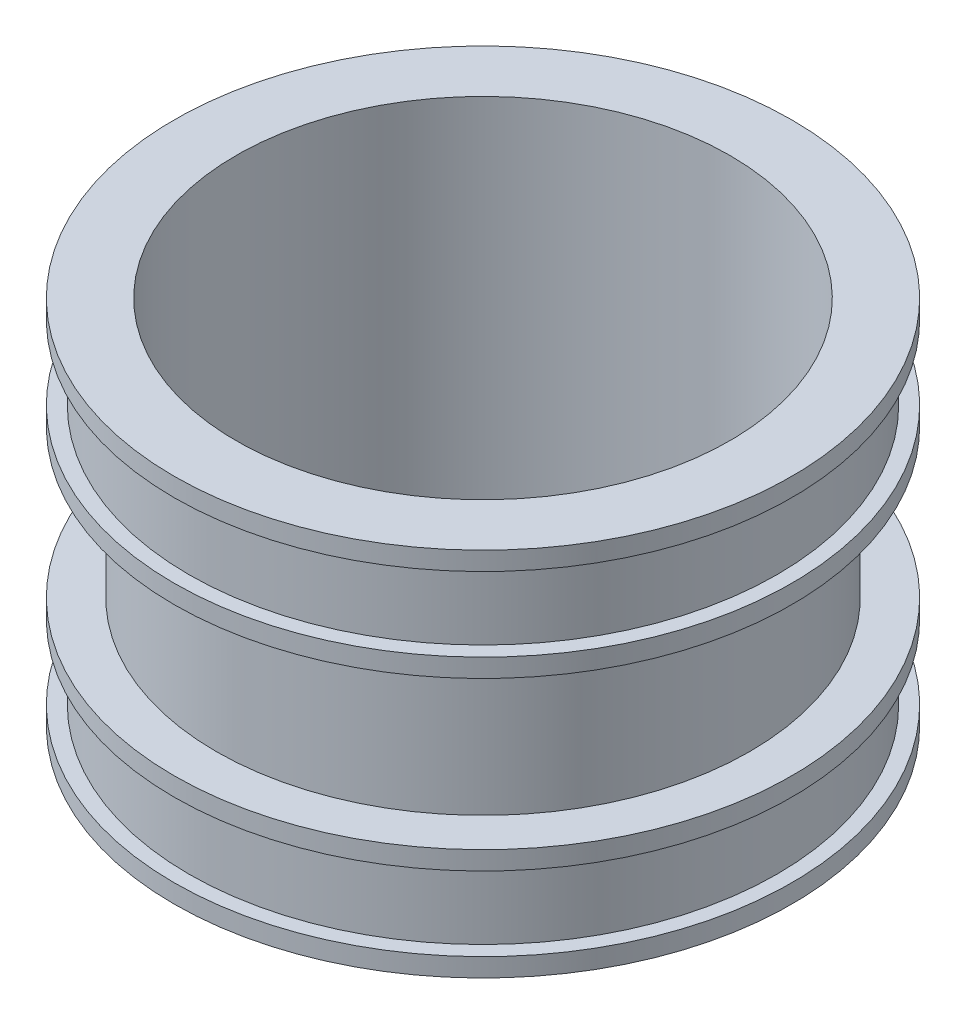
ISO-10303-21;
HEADER;
FILE_DESCRIPTION(('STEP AP214'),'2;1');
FILE_NAME('part.step','',(''),(''),'','','');
FILE_SCHEMA(('AUTOMOTIVE_DESIGN { 1 0 10303 214 1 1 1 1 }'));
ENDSEC;
DATA;
#1=APPLICATION_CONTEXT('core data for automotive mechanical design processes');
#2=APPLICATION_PROTOCOL_DEFINITION('international standard','automotive_design',2000,#1);
#3=PRODUCT_CONTEXT('',#1,'mechanical');
#4=PRODUCT('Part','Part','',(#3));
#5=PRODUCT_RELATED_PRODUCT_CATEGORY('part','',(#4));
#6=PRODUCT_DEFINITION_FORMATION('','',#4);
#7=PRODUCT_DEFINITION_CONTEXT('part definition',#1,'design');
#8=PRODUCT_DEFINITION('design','',#6,#7);
#9=PRODUCT_DEFINITION_SHAPE('','',#8);
#10=(LENGTH_UNIT() NAMED_UNIT(*) SI_UNIT(.MILLI.,.METRE.));
#11=(NAMED_UNIT(*) PLANE_ANGLE_UNIT() SI_UNIT($,.RADIAN.));
#12=(NAMED_UNIT(*) SI_UNIT($,.STERADIAN.) SOLID_ANGLE_UNIT());
#13=UNCERTAINTY_MEASURE_WITH_UNIT(LENGTH_MEASURE(1.E-05),#10,'distance_accuracy_value','');
#14=(GEOMETRIC_REPRESENTATION_CONTEXT(3) GLOBAL_UNCERTAINTY_ASSIGNED_CONTEXT((#13)) GLOBAL_UNIT_ASSIGNED_CONTEXT((#10,
#11,#12)) REPRESENTATION_CONTEXT('',''));
#15=CARTESIAN_POINT('',(0.,0.,0.));
#16=DIRECTION('',(0.,0.,1.));
#17=DIRECTION('',(1.,0.,0.));
#18=AXIS2_PLACEMENT_3D('',#15,#16,#17);
#19=CARTESIAN_POINT('',(0.,0.,0.));
#20=DIRECTION('',(0.,-1.,0.));
#21=DIRECTION('',(0.,0.,-1.));
#22=AXIS2_PLACEMENT_3D('',#19,#20,#21);
#23=CYLINDRICAL_SURFACE('',#22,100.);
#24=CARTESIAN_POINT('',(0.,0.,0.));
#25=DIRECTION('',(0.,-1.,0.));
#26=DIRECTION('',(0.,0.,-1.));
#27=AXIS2_PLACEMENT_3D('',#24,#25,#26);
#28=CIRCLE('',#27,100.);
#29=CARTESIAN_POINT('',(0.,0.,-100.));
#30=VERTEX_POINT('',#29);
#31=EDGE_CURVE('E87',#30,#30,#28,.T.);
#32=ORIENTED_EDGE('',*,*,#31,.T.);
#33=EDGE_LOOP('',(#32));
#34=FACE_BOUND('',#33,.T.);
#35=CARTESIAN_POINT('',(0.,150.,0.));
#36=DIRECTION('',(0.,-1.,0.));
#37=DIRECTION('',(0.,0.,-1.));
#38=AXIS2_PLACEMENT_3D('',#35,#36,#37);
#39=CIRCLE('',#38,100.);
#40=CARTESIAN_POINT('',(0.,150.,-100.));
#41=VERTEX_POINT('',#40);
#42=EDGE_CURVE('E10',#41,#41,#39,.T.);
#43=ORIENTED_EDGE('',*,*,#42,.F.);
#44=EDGE_LOOP('',(#43));
#45=FACE_BOUND('',#44,.T.);
#46=ADVANCED_FACE('F35',(#34,#45),#23,.F.);
#47=CARTESIAN_POINT('',(100.,150.,0.));
#48=DIRECTION('',(0.,1.,0.));
#49=DIRECTION('',(0.,0.,1.));
#50=AXIS2_PLACEMENT_3D('',#47,#48,#49);
#51=PLANE('',#50);
#52=ORIENTED_EDGE('',*,*,#42,.T.);
#53=EDGE_LOOP('',(#52));
#54=FACE_BOUND('',#53,.T.);
#55=CARTESIAN_POINT('',(0.,150.,0.));
#56=DIRECTION('',(0.,-1.,0.));
#57=DIRECTION('',(0.,0.,-1.));
#58=AXIS2_PLACEMENT_3D('',#55,#56,#57);
#59=CIRCLE('',#58,125.);
#60=CARTESIAN_POINT('',(0.,150.,-125.));
#61=VERTEX_POINT('',#60);
#62=EDGE_CURVE('E41',#61,#61,#59,.T.);
#63=ORIENTED_EDGE('',*,*,#62,.F.);
#64=EDGE_LOOP('',(#63));
#65=FACE_BOUND('',#64,.T.);
#66=ADVANCED_FACE('F105',(#54,#65),#51,.T.);
#67=CARTESIAN_POINT('',(0.,0.,0.));
#68=DIRECTION('',(0.,-1.,0.));
#69=DIRECTION('',(0.,0.,-1.));
#70=AXIS2_PLACEMENT_3D('',#67,#68,#69);
#71=CYLINDRICAL_SURFACE('',#70,125.);
#72=ORIENTED_EDGE('',*,*,#62,.T.);
#73=EDGE_LOOP('',(#72));
#74=FACE_BOUND('',#73,.T.);
#75=CARTESIAN_POINT('',(0.,142.5,0.));
#76=DIRECTION('',(0.,-1.,0.));
#77=DIRECTION('',(0.,0.,-1.));
#78=AXIS2_PLACEMENT_3D('',#75,#76,#77);
#79=CIRCLE('',#78,125.);
#80=CARTESIAN_POINT('',(0.,142.5,-125.));
#81=VERTEX_POINT('',#80);
#82=EDGE_CURVE('E45',#81,#81,#79,.T.);
#83=ORIENTED_EDGE('',*,*,#82,.F.);
#84=EDGE_LOOP('',(#83));
#85=FACE_BOUND('',#84,.T.);
#86=ADVANCED_FACE('F109',(#74,#85),#71,.T.);
#87=CARTESIAN_POINT('',(125.,142.5,0.));
#88=DIRECTION('',(0.,-1.,0.));
#89=DIRECTION('',(0.,0.,-1.));
#90=AXIS2_PLACEMENT_3D('',#87,#88,#89);
#91=PLANE('',#90);
#92=ORIENTED_EDGE('',*,*,#82,.T.);
#93=EDGE_LOOP('',(#92));
#94=FACE_BOUND('',#93,.T.);
#95=CARTESIAN_POINT('',(0.,142.5,0.));
#96=DIRECTION('',(0.,-1.,0.));
#97=DIRECTION('',(0.,0.,-1.));
#98=AXIS2_PLACEMENT_3D('',#95,#96,#97);
#99=CIRCLE('',#98,119.);
#100=CARTESIAN_POINT('',(0.,142.5,-119.));
#101=VERTEX_POINT('',#100);
#102=EDGE_CURVE('E49',#101,#101,#99,.T.);
#103=ORIENTED_EDGE('',*,*,#102,.F.);
#104=EDGE_LOOP('',(#103));
#105=FACE_BOUND('',#104,.T.);
#106=ADVANCED_FACE('F113',(#94,#105),#91,.T.);
#107=CARTESIAN_POINT('',(0.,0.,0.));
#108=DIRECTION('',(0.,-1.,0.));
#109=DIRECTION('',(0.,0.,-1.));
#110=AXIS2_PLACEMENT_3D('',#107,#108,#109);
#111=CYLINDRICAL_SURFACE('',#110,119.);
#112=ORIENTED_EDGE('',*,*,#102,.T.);
#113=EDGE_LOOP('',(#112));
#114=FACE_BOUND('',#113,.T.);
#115=CARTESIAN_POINT('',(0.,112.5,0.));
#116=DIRECTION('',(0.,-1.,0.));
#117=DIRECTION('',(0.,0.,-1.));
#118=AXIS2_PLACEMENT_3D('',#115,#116,#117);
#119=CIRCLE('',#118,119.);
#120=CARTESIAN_POINT('',(0.,112.5,-119.));
#121=VERTEX_POINT('',#120);
#122=EDGE_CURVE('E54',#121,#121,#119,.T.);
#123=ORIENTED_EDGE('',*,*,#122,.F.);
#124=EDGE_LOOP('',(#123));
#125=FACE_BOUND('',#124,.T.);
#126=ADVANCED_FACE('F119',(#114,#125),#111,.T.);
#127=CARTESIAN_POINT('',(119.,112.5,0.));
#128=DIRECTION('',(0.,1.,0.));
#129=DIRECTION('',(0.,0.,1.));
#130=AXIS2_PLACEMENT_3D('',#127,#128,#129);
#131=PLANE('',#130);
#132=ORIENTED_EDGE('',*,*,#122,.T.);
#133=EDGE_LOOP('',(#132));
#134=FACE_BOUND('',#133,.T.);
#135=CARTESIAN_POINT('',(0.,112.5,0.));
#136=DIRECTION('',(0.,-1.,0.));
#137=DIRECTION('',(0.,0.,-1.));
#138=AXIS2_PLACEMENT_3D('',#135,#136,#137);
#139=CIRCLE('',#138,125.);
#140=CARTESIAN_POINT('',(0.,112.5,-125.));
#141=VERTEX_POINT('',#140);
#142=EDGE_CURVE('E57',#141,#141,#139,.T.);
#143=ORIENTED_EDGE('',*,*,#142,.F.);
#144=EDGE_LOOP('',(#143));
#145=FACE_BOUND('',#144,.T.);
#146=ADVANCED_FACE('F123',(#134,#145),#131,.T.);
#147=CARTESIAN_POINT('',(0.,0.,0.));
#148=DIRECTION('',(0.,-1.,0.));
#149=DIRECTION('',(0.,0.,-1.));
#150=AXIS2_PLACEMENT_3D('',#147,#148,#149);
#151=CYLINDRICAL_SURFACE('',#150,125.);
#152=ORIENTED_EDGE('',*,*,#142,.T.);
#153=EDGE_LOOP('',(#152));
#154=FACE_BOUND('',#153,.T.);
#155=CARTESIAN_POINT('',(0.,105.,0.));
#156=DIRECTION('',(0.,-1.,0.));
#157=DIRECTION('',(0.,0.,-1.));
#158=AXIS2_PLACEMENT_3D('',#155,#156,#157);
#159=CIRCLE('',#158,125.);
#160=CARTESIAN_POINT('',(0.,105.,-125.));
#161=VERTEX_POINT('',#160);
#162=EDGE_CURVE('E60',#161,#161,#159,.T.);
#163=ORIENTED_EDGE('',*,*,#162,.F.);
#164=EDGE_LOOP('',(#163));
#165=FACE_BOUND('',#164,.T.);
#166=ADVANCED_FACE('F127',(#154,#165),#151,.T.);
#167=CARTESIAN_POINT('',(125.,105.,0.));
#168=DIRECTION('',(0.,-1.,0.));
#169=DIRECTION('',(0.,0.,-1.));
#170=AXIS2_PLACEMENT_3D('',#167,#168,#169);
#171=PLANE('',#170);
#172=ORIENTED_EDGE('',*,*,#162,.T.);
#173=EDGE_LOOP('',(#172));
#174=FACE_BOUND('',#173,.T.);
#175=CARTESIAN_POINT('',(0.,105.,0.));
#176=DIRECTION('',(0.,-1.,0.));
#177=DIRECTION('',(0.,0.,-1.));
#178=AXIS2_PLACEMENT_3D('',#175,#176,#177);
#179=CIRCLE('',#178,108.);
#180=CARTESIAN_POINT('',(0.,105.,-108.));
#181=VERTEX_POINT('',#180);
#182=EDGE_CURVE('E63',#181,#181,#179,.T.);
#183=ORIENTED_EDGE('',*,*,#182,.F.);
#184=EDGE_LOOP('',(#183));
#185=FACE_BOUND('',#184,.T.);
#186=ADVANCED_FACE('F131',(#174,#185),#171,.T.);
#187=CARTESIAN_POINT('',(0.,0.,0.));
#188=DIRECTION('',(0.,-1.,0.));
#189=DIRECTION('',(0.,0.,-1.));
#190=AXIS2_PLACEMENT_3D('',#187,#188,#189);
#191=CYLINDRICAL_SURFACE('',#190,108.);
#192=ORIENTED_EDGE('',*,*,#182,.T.);
#193=EDGE_LOOP('',(#192));
#194=FACE_BOUND('',#193,.T.);
#195=CARTESIAN_POINT('',(0.,45.,0.));
#196=DIRECTION('',(0.,-1.,0.));
#197=DIRECTION('',(0.,0.,-1.));
#198=AXIS2_PLACEMENT_3D('',#195,#196,#197);
#199=CIRCLE('',#198,108.);
#200=CARTESIAN_POINT('',(0.,45.,-108.));
#201=VERTEX_POINT('',#200);
#202=EDGE_CURVE('E66',#201,#201,#199,.T.);
#203=ORIENTED_EDGE('',*,*,#202,.F.);
#204=EDGE_LOOP('',(#203));
#205=FACE_BOUND('',#204,.T.);
#206=ADVANCED_FACE('F135',(#194,#205),#191,.T.);
#207=CARTESIAN_POINT('',(108.,45.,0.));
#208=DIRECTION('',(0.,1.,0.));
#209=DIRECTION('',(0.,0.,1.));
#210=AXIS2_PLACEMENT_3D('',#207,#208,#209);
#211=PLANE('',#210);
#212=ORIENTED_EDGE('',*,*,#202,.T.);
#213=EDGE_LOOP('',(#212));
#214=FACE_BOUND('',#213,.T.);
#215=CARTESIAN_POINT('',(0.,45.,0.));
#216=DIRECTION('',(0.,-1.,0.));
#217=DIRECTION('',(0.,0.,-1.));
#218=AXIS2_PLACEMENT_3D('',#215,#216,#217);
#219=CIRCLE('',#218,125.);
#220=CARTESIAN_POINT('',(0.,45.,-125.));
#221=VERTEX_POINT('',#220);
#222=EDGE_CURVE('E69',#221,#221,#219,.T.);
#223=ORIENTED_EDGE('',*,*,#222,.F.);
#224=EDGE_LOOP('',(#223));
#225=FACE_BOUND('',#224,.T.);
#226=ADVANCED_FACE('F139',(#214,#225),#211,.T.);
#227=CARTESIAN_POINT('',(0.,0.,0.));
#228=DIRECTION('',(0.,-1.,0.));
#229=DIRECTION('',(0.,0.,-1.));
#230=AXIS2_PLACEMENT_3D('',#227,#228,#229);
#231=CYLINDRICAL_SURFACE('',#230,125.);
#232=ORIENTED_EDGE('',*,*,#222,.T.);
#233=EDGE_LOOP('',(#232));
#234=FACE_BOUND('',#233,.T.);
#235=CARTESIAN_POINT('',(0.,37.5,0.));
#236=DIRECTION('',(0.,-1.,0.));
#237=DIRECTION('',(0.,0.,-1.));
#238=AXIS2_PLACEMENT_3D('',#235,#236,#237);
#239=CIRCLE('',#238,125.);
#240=CARTESIAN_POINT('',(0.,37.5,-125.));
#241=VERTEX_POINT('',#240);
#242=EDGE_CURVE('E72',#241,#241,#239,.T.);
#243=ORIENTED_EDGE('',*,*,#242,.F.);
#244=EDGE_LOOP('',(#243));
#245=FACE_BOUND('',#244,.T.);
#246=ADVANCED_FACE('F143',(#234,#245),#231,.T.);
#247=CARTESIAN_POINT('',(119.,37.5,0.));
#248=DIRECTION('',(0.,-1.,0.));
#249=DIRECTION('',(0.,0.,-1.));
#250=AXIS2_PLACEMENT_3D('',#247,#248,#249);
#251=PLANE('',#250);
#252=ORIENTED_EDGE('',*,*,#242,.T.);
#253=EDGE_LOOP('',(#252));
#254=FACE_BOUND('',#253,.T.);
#255=CARTESIAN_POINT('',(0.,37.5,0.));
#256=DIRECTION('',(0.,-1.,0.));
#257=DIRECTION('',(0.,0.,-1.));
#258=AXIS2_PLACEMENT_3D('',#255,#256,#257);
#259=CIRCLE('',#258,119.);
#260=CARTESIAN_POINT('',(0.,37.5,-119.));
#261=VERTEX_POINT('',#260);
#262=EDGE_CURVE('E75',#261,#261,#259,.T.);
#263=ORIENTED_EDGE('',*,*,#262,.F.);
#264=EDGE_LOOP('',(#263));
#265=FACE_BOUND('',#264,.T.);
#266=ADVANCED_FACE('F147',(#254,#265),#251,.T.);
#267=CARTESIAN_POINT('',(0.,0.,0.));
#268=DIRECTION('',(0.,-1.,0.));
#269=DIRECTION('',(0.,0.,-1.));
#270=AXIS2_PLACEMENT_3D('',#267,#268,#269);
#271=CYLINDRICAL_SURFACE('',#270,119.);
#272=ORIENTED_EDGE('',*,*,#262,.T.);
#273=EDGE_LOOP('',(#272));
#274=FACE_BOUND('',#273,.T.);
#275=CARTESIAN_POINT('',(0.,7.50000000000001,0.));
#276=DIRECTION('',(0.,-1.,0.));
#277=DIRECTION('',(0.,0.,-1.));
#278=AXIS2_PLACEMENT_3D('',#275,#276,#277);
#279=CIRCLE('',#278,119.);
#280=CARTESIAN_POINT('',(0.,7.50000000000001,-119.));
#281=VERTEX_POINT('',#280);
#282=EDGE_CURVE('E78',#281,#281,#279,.T.);
#283=ORIENTED_EDGE('',*,*,#282,.F.);
#284=EDGE_LOOP('',(#283));
#285=FACE_BOUND('',#284,.T.);
#286=ADVANCED_FACE('F151',(#274,#285),#271,.T.);
#287=CARTESIAN_POINT('',(125.,7.5,0.));
#288=DIRECTION('',(0.,1.,0.));
#289=DIRECTION('',(0.,0.,1.));
#290=AXIS2_PLACEMENT_3D('',#287,#288,#289);
#291=PLANE('',#290);
#292=ORIENTED_EDGE('',*,*,#282,.T.);
#293=EDGE_LOOP('',(#292));
#294=FACE_BOUND('',#293,.T.);
#295=CARTESIAN_POINT('',(0.,7.5,0.));
#296=DIRECTION('',(0.,-1.,0.));
#297=DIRECTION('',(0.,0.,-1.));
#298=AXIS2_PLACEMENT_3D('',#295,#296,#297);
#299=CIRCLE('',#298,125.);
#300=CARTESIAN_POINT('',(0.,7.5,-125.));
#301=VERTEX_POINT('',#300);
#302=EDGE_CURVE('E81',#301,#301,#299,.T.);
#303=ORIENTED_EDGE('',*,*,#302,.F.);
#304=EDGE_LOOP('',(#303));
#305=FACE_BOUND('',#304,.T.);
#306=ADVANCED_FACE('F101',(#294,#305),#291,.T.);
#307=CARTESIAN_POINT('',(0.,0.,0.));
#308=DIRECTION('',(0.,-1.,0.));
#309=DIRECTION('',(0.,0.,-1.));
#310=AXIS2_PLACEMENT_3D('',#307,#308,#309);
#311=CYLINDRICAL_SURFACE('',#310,125.);
#312=ORIENTED_EDGE('',*,*,#302,.T.);
#313=EDGE_LOOP('',(#312));
#314=FACE_BOUND('',#313,.T.);
#315=CARTESIAN_POINT('',(0.,0.,0.));
#316=DIRECTION('',(0.,-1.,0.));
#317=DIRECTION('',(0.,0.,-1.));
#318=AXIS2_PLACEMENT_3D('',#315,#316,#317);
#319=CIRCLE('',#318,125.);
#320=CARTESIAN_POINT('',(0.,0.,-125.));
#321=VERTEX_POINT('',#320);
#322=EDGE_CURVE('E84',#321,#321,#319,.T.);
#323=ORIENTED_EDGE('',*,*,#322,.F.);
#324=EDGE_LOOP('',(#323));
#325=FACE_BOUND('',#324,.T.);
#326=ADVANCED_FACE('F95',(#314,#325),#311,.T.);
#327=CARTESIAN_POINT('',(125.,0.,0.));
#328=DIRECTION('',(0.,-1.,0.));
#329=DIRECTION('',(0.,0.,-1.));
#330=AXIS2_PLACEMENT_3D('',#327,#328,#329);
#331=PLANE('',#330);
#332=ORIENTED_EDGE('',*,*,#322,.T.);
#333=EDGE_LOOP('',(#332));
#334=FACE_BOUND('',#333,.T.);
#335=ORIENTED_EDGE('',*,*,#31,.F.);
#336=EDGE_LOOP('',(#335));
#337=FACE_BOUND('',#336,.T.);
#338=ADVANCED_FACE('F93',(#334,#337),#331,.T.);
#339=CLOSED_SHELL('',(#46,#66,#86,#106,#126,#146,#166,#186,#206,#226,#246,#266,#286,#306,#326,#338));
#340=MANIFOLD_SOLID_BREP('B2',#339);
#341=ADVANCED_BREP_SHAPE_REPRESENTATION('',(#18,#340),#14);
#342=SHAPE_DEFINITION_REPRESENTATION(#9,#341);
ENDSEC;
END-ISO-10303-21;
